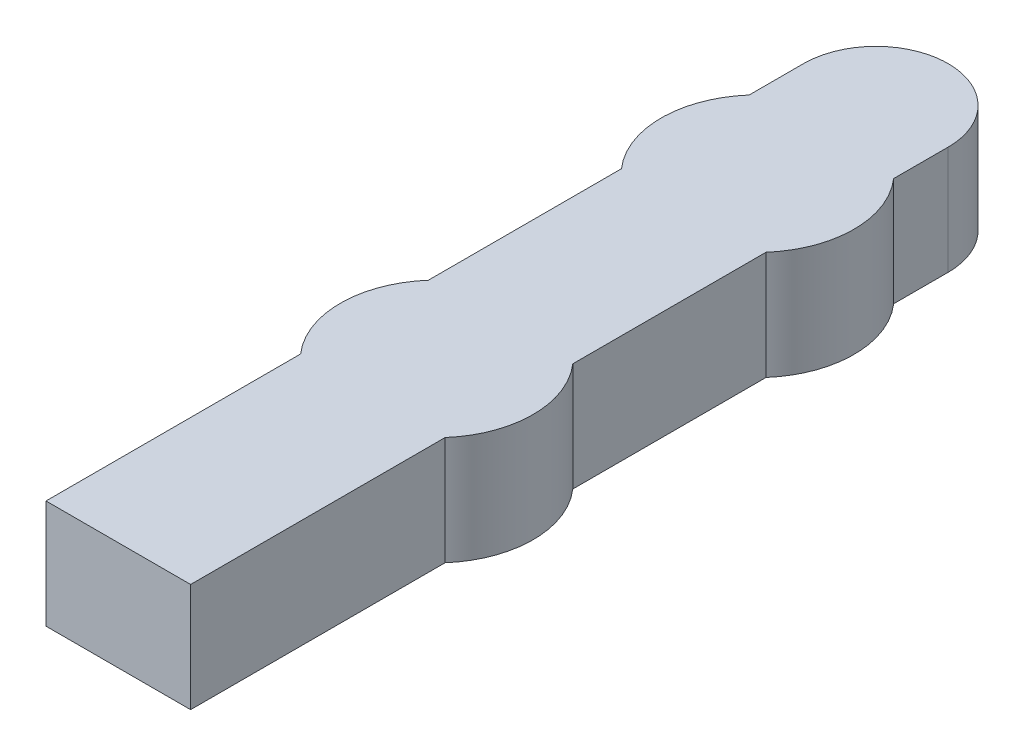
ISO-10303-21;
HEADER;
FILE_DESCRIPTION(('STEP AP214'),'2;1');
FILE_NAME('part.step','',(''),(''),'','','');
FILE_SCHEMA(('AUTOMOTIVE_DESIGN { 1 0 10303 214 1 1 1 1 }'));
ENDSEC;
DATA;
#1=APPLICATION_CONTEXT('core data for automotive mechanical design processes');
#2=APPLICATION_PROTOCOL_DEFINITION('international standard','automotive_design',2000,#1);
#3=PRODUCT_CONTEXT('',#1,'mechanical');
#4=PRODUCT('Part','Part','',(#3));
#5=PRODUCT_RELATED_PRODUCT_CATEGORY('part','',(#4));
#6=PRODUCT_DEFINITION_FORMATION('','',#4);
#7=PRODUCT_DEFINITION_CONTEXT('part definition',#1,'design');
#8=PRODUCT_DEFINITION('design','',#6,#7);
#9=PRODUCT_DEFINITION_SHAPE('','',#8);
#10=(LENGTH_UNIT() NAMED_UNIT(*) SI_UNIT(.MILLI.,.METRE.));
#11=(NAMED_UNIT(*) PLANE_ANGLE_UNIT() SI_UNIT($,.RADIAN.));
#12=(NAMED_UNIT(*) SI_UNIT($,.STERADIAN.) SOLID_ANGLE_UNIT());
#13=UNCERTAINTY_MEASURE_WITH_UNIT(LENGTH_MEASURE(1.E-05),#10,'distance_accuracy_value','');
#14=(GEOMETRIC_REPRESENTATION_CONTEXT(3) GLOBAL_UNCERTAINTY_ASSIGNED_CONTEXT((#13)) GLOBAL_UNIT_ASSIGNED_CONTEXT((#10,
#11,#12)) REPRESENTATION_CONTEXT('',''));
#15=CARTESIAN_POINT('',(0.,0.,0.));
#16=DIRECTION('',(0.,0.,1.));
#17=DIRECTION('',(1.,0.,0.));
#18=AXIS2_PLACEMENT_3D('',#15,#16,#17);
#19=CARTESIAN_POINT('',(-3.16909499193774,-36.5511805975622,-24.764773285915));
#20=DIRECTION('',(0.,-1.,0.));
#21=DIRECTION('',(0.,0.,-1.));
#22=AXIS2_PLACEMENT_3D('',#19,#20,#21);
#23=PLANE('',#22);
#24=CARTESIAN_POINT('',(-2.96909499193774,-36.5511805975622,-23.2791491687025));
#25=CARTESIAN_POINT('',(-3.2024283252711,-36.5511805975622,-23.543724299809));
#26=CARTESIAN_POINT('',(-2.96909499193772,-36.5511805975622,-23.8082994309155));
#27=(BOUNDED_CURVE() B_SPLINE_CURVE(2,(#24,#25,#26),.UNSPECIFIED.,.F.,
.F.) B_SPLINE_CURVE_WITH_KNOTS((3,3),(-11.5360013624518,-10.9578139642011),
.UNSPECIFIED.) CURVE() GEOMETRIC_REPRESENTATION_ITEM() RATIONAL_B_SPLINE_CURVE((1.,
0.749999999999968,1.)) REPRESENTATION_ITEM(''));
#28=CARTESIAN_POINT('',(-2.96909499193774,-36.5511805975622,-23.2791491687025));
#29=VERTEX_POINT('',#28);
#30=CARTESIAN_POINT('',(-2.96909499193772,-36.5511805975622,-23.8082994309155));
#31=VERTEX_POINT('',#30);
#32=EDGE_CURVE('E217',#29,#31,#27,.T.);
#33=ORIENTED_EDGE('',*,*,#32,.T.);
#34=CARTESIAN_POINT('',(-2.96909499193772,-36.5511805975622,-23.8082994309155));
#35=CARTESIAN_POINT('',(-2.96909499193773,-36.5511805975622,-23.9213501468244));
#36=CARTESIAN_POINT('',(-2.96909499193774,-36.5511805975622,-24.0344008627333));
#37=(BOUNDED_CURVE() B_SPLINE_CURVE(2,(#34,#35,#36),.UNSPECIFIED.,.F.,
.F.) B_SPLINE_CURVE_WITH_KNOTS((3,3),(-10.9578139642011,-10.7317125323832),
.UNSPECIFIED.) CURVE() GEOMETRIC_REPRESENTATION_ITEM() RATIONAL_B_SPLINE_CURVE((1.,1.,1.)) REPRESENTATION_ITEM(''));
#38=CARTESIAN_POINT('',(-2.96909499193774,-36.5511805975622,-24.0344008627333));
#39=VERTEX_POINT('',#38);
#40=EDGE_CURVE('E239',#31,#39,#37,.T.);
#41=ORIENTED_EDGE('',*,*,#40,.T.);
#42=CARTESIAN_POINT('',(-2.96909499193774,-36.5511805975622,-24.0344008627333));
#43=CARTESIAN_POINT('',(-2.96909499193775,-36.5511805975622,-24.3344008627333));
#44=CARTESIAN_POINT('',(-2.66909499193774,-36.5511805975622,-24.3344008627333));
#45=CARTESIAN_POINT('',(-2.36909499193774,-36.5511805975622,-24.3344008627333));
#46=CARTESIAN_POINT('',(-2.36909499193774,-36.5511805975622,-24.0344008627333));
#47=(BOUNDED_CURVE() B_SPLINE_CURVE(2,(#42,#43,#44,#45,#46),.UNSPECIFIED.,.F.,
.F.) B_SPLINE_CURVE_WITH_KNOTS((3,2,3),(-10.7317125323832,-10.2604736343447,-9.78923473630626),
.UNSPECIFIED.) CURVE() GEOMETRIC_REPRESENTATION_ITEM() RATIONAL_B_SPLINE_CURVE((1.,
0.707106781186548,1.,0.707106781186548,1.)) REPRESENTATION_ITEM(''));
#48=CARTESIAN_POINT('',(-2.36909499193774,-36.5511805975622,-24.0344008627333));
#49=VERTEX_POINT('',#48);
#50=EDGE_CURVE('E68',#39,#49,#47,.T.);
#51=ORIENTED_EDGE('',*,*,#50,.T.);
#52=CARTESIAN_POINT('',(-2.36909499193774,-36.5511805975622,-24.0344008627333));
#53=CARTESIAN_POINT('',(-2.36909499193774,-36.5511805975622,-23.9213501468244));
#54=CARTESIAN_POINT('',(-2.36909499193773,-36.5511805975622,-23.8082994309155));
#55=(BOUNDED_CURVE() B_SPLINE_CURVE(2,(#52,#53,#54),.UNSPECIFIED.,.F.,
.F.) B_SPLINE_CURVE_WITH_KNOTS((3,3),(-9.78923473630626,-9.56313330448839),
.UNSPECIFIED.) CURVE() GEOMETRIC_REPRESENTATION_ITEM() RATIONAL_B_SPLINE_CURVE((1.,1.,1.)) REPRESENTATION_ITEM(''));
#56=CARTESIAN_POINT('',(-2.36909499193773,-36.5511805975622,-23.8082994309155));
#57=VERTEX_POINT('',#56);
#58=EDGE_CURVE('E89',#49,#57,#55,.T.);
#59=ORIENTED_EDGE('',*,*,#58,.T.);
#60=CARTESIAN_POINT('',(-2.36909499193773,-36.5511805975622,-23.8082994309155));
#61=CARTESIAN_POINT('',(-2.13576165860442,-36.5511805975623,-23.5437242998091));
#62=CARTESIAN_POINT('',(-2.36909499193775,-36.5511805975622,-23.2791491687025));
#63=(BOUNDED_CURVE() B_SPLINE_CURVE(2,(#60,#61,#62),.UNSPECIFIED.,.F.,
.F.) B_SPLINE_CURVE_WITH_KNOTS((3,3),(-9.56313330448839,-8.98494590623766),
.UNSPECIFIED.) CURVE() GEOMETRIC_REPRESENTATION_ITEM() RATIONAL_B_SPLINE_CURVE((1.,0.75,1.)) REPRESENTATION_ITEM(''));
#64=CARTESIAN_POINT('',(-2.36909499193775,-36.5511805975622,-23.2791491687025));
#65=VERTEX_POINT('',#64);
#66=EDGE_CURVE('E182',#57,#65,#63,.T.);
#67=ORIENTED_EDGE('',*,*,#66,.T.);
#68=CARTESIAN_POINT('',(-2.36909499193775,-36.5511805975622,-23.2791491687025));
#69=CARTESIAN_POINT('',(-2.36909499193775,-36.5511805975622,-22.878090338546));
#70=CARTESIAN_POINT('',(-2.36909499193775,-36.5511805975622,-22.4770315083895));
#71=(BOUNDED_CURVE() B_SPLINE_CURVE(2,(#68,#69,#70),.UNSPECIFIED.,.F.,
.F.) B_SPLINE_CURVE_WITH_KNOTS((3,3),(-8.98494590623766,-8.18282824592458),
.UNSPECIFIED.) CURVE() GEOMETRIC_REPRESENTATION_ITEM() RATIONAL_B_SPLINE_CURVE((1.,1.,1.)) REPRESENTATION_ITEM(''));
#72=CARTESIAN_POINT('',(-2.36909499193775,-36.5511805975622,-22.4770315083895));
#73=VERTEX_POINT('',#72);
#74=EDGE_CURVE('E179',#65,#73,#71,.T.);
#75=ORIENTED_EDGE('',*,*,#74,.T.);
#76=CARTESIAN_POINT('',(-2.36909499193775,-36.5511805975622,-22.4770315083895));
#77=CARTESIAN_POINT('',(-2.13576165860439,-36.5511805975622,-22.212456377283));
#78=CARTESIAN_POINT('',(-2.36909499193775,-36.5511805975622,-21.9478812461765));
#79=(BOUNDED_CURVE() B_SPLINE_CURVE(2,(#76,#77,#78),.UNSPECIFIED.,.F.,
.F.) B_SPLINE_CURVE_WITH_KNOTS((3,3),(-8.18282824592458,-7.60464084767382),
.UNSPECIFIED.) CURVE() GEOMETRIC_REPRESENTATION_ITEM() RATIONAL_B_SPLINE_CURVE((1.,
0.74999999999998,1.)) REPRESENTATION_ITEM(''));
#80=CARTESIAN_POINT('',(-2.36909499193775,-36.5511805975622,-21.9478812461765));
#81=VERTEX_POINT('',#80);
#82=EDGE_CURVE('E166',#73,#81,#79,.T.);
#83=ORIENTED_EDGE('',*,*,#82,.T.);
#84=CARTESIAN_POINT('',(-2.36909499193775,-36.5511805975622,-21.9478812461765));
#85=CARTESIAN_POINT('',(-2.36909499193776,-36.5511805975622,-21.4196513617284));
#86=CARTESIAN_POINT('',(-2.36909499193776,-36.5511805975622,-20.8914214772802));
#87=(BOUNDED_CURVE() B_SPLINE_CURVE(2,(#84,#85,#86),.UNSPECIFIED.,.F.,
.F.) B_SPLINE_CURVE_WITH_KNOTS((3,3),(-7.60464084767382,-6.54818107877749),
.UNSPECIFIED.) CURVE() GEOMETRIC_REPRESENTATION_ITEM() RATIONAL_B_SPLINE_CURVE((1.,1.,1.)) REPRESENTATION_ITEM(''));
#88=CARTESIAN_POINT('',(-2.36909499193776,-36.5511805975622,-20.8914214772802));
#89=VERTEX_POINT('',#88);
#90=EDGE_CURVE('E22',#81,#89,#87,.T.);
#91=ORIENTED_EDGE('',*,*,#90,.T.);
#92=CARTESIAN_POINT('',(-2.36909499193776,-36.5511805975622,-20.8914214772802));
#93=CARTESIAN_POINT('',(-2.66909499193775,-36.5511805975622,-20.8914214772802));
#94=CARTESIAN_POINT('',(-2.96909499193774,-36.5511805975622,-20.8914214772802));
#95=(BOUNDED_CURVE() B_SPLINE_CURVE(2,(#92,#93,#94),.UNSPECIFIED.,.F.,
.F.) B_SPLINE_CURVE_WITH_KNOTS((3,3),(-6.54818107877749,-5.94818107877749),
.UNSPECIFIED.) CURVE() GEOMETRIC_REPRESENTATION_ITEM() RATIONAL_B_SPLINE_CURVE((1.,1.,1.)) REPRESENTATION_ITEM(''));
#96=CARTESIAN_POINT('',(-2.96909499193774,-36.5511805975622,-20.8914214772802));
#97=VERTEX_POINT('',#96);
#98=EDGE_CURVE('E144',#89,#97,#95,.T.);
#99=ORIENTED_EDGE('',*,*,#98,.T.);
#100=CARTESIAN_POINT('',(-2.96909499193774,-36.5511805975622,-20.8914214772802));
#101=CARTESIAN_POINT('',(-2.96909499193774,-36.5511805975622,-21.4196513617284));
#102=CARTESIAN_POINT('',(-2.96909499193774,-36.5511805975622,-21.9478812461765));
#103=(BOUNDED_CURVE() B_SPLINE_CURVE(2,(#100,#101,#102),.UNSPECIFIED.,.F.,
.F.) B_SPLINE_CURVE_WITH_KNOTS((3,3),(-5.94818107877749,-4.89172130988116),
.UNSPECIFIED.) CURVE() GEOMETRIC_REPRESENTATION_ITEM() RATIONAL_B_SPLINE_CURVE((1.,1.,1.)) REPRESENTATION_ITEM(''));
#104=CARTESIAN_POINT('',(-2.96909499193774,-36.5511805975622,-21.9478812461765));
#105=VERTEX_POINT('',#104);
#106=EDGE_CURVE('E290',#97,#105,#103,.T.);
#107=ORIENTED_EDGE('',*,*,#106,.T.);
#108=CARTESIAN_POINT('',(-2.96909499193774,-36.5511805975622,-21.9478812461765));
#109=CARTESIAN_POINT('',(-3.20242832527105,-36.5511805975619,-22.2124563772828));
#110=CARTESIAN_POINT('',(-2.96909499193774,-36.5511805975622,-22.4770315083895));
#111=(BOUNDED_CURVE() B_SPLINE_CURVE(2,(#108,#109,#110),.UNSPECIFIED.,.F.,
.F.) B_SPLINE_CURVE_WITH_KNOTS((3,3),(-4.89172130988116,-4.31353391163042),
.UNSPECIFIED.) CURVE() GEOMETRIC_REPRESENTATION_ITEM() RATIONAL_B_SPLINE_CURVE((1.,0.75,1.)) REPRESENTATION_ITEM(''));
#112=CARTESIAN_POINT('',(-2.96909499193774,-36.5511805975622,-22.4770315083895));
#113=VERTEX_POINT('',#112);
#114=EDGE_CURVE('E257',#105,#113,#111,.T.);
#115=ORIENTED_EDGE('',*,*,#114,.T.);
#116=CARTESIAN_POINT('',(-2.96909499193774,-36.5511805975622,-22.4770315083895));
#117=CARTESIAN_POINT('',(-2.96909499193774,-36.5511805975622,-22.878090338546));
#118=CARTESIAN_POINT('',(-2.96909499193774,-36.5511805975622,-23.2791491687025));
#119=(BOUNDED_CURVE() B_SPLINE_CURVE(2,(#116,#117,#118),.UNSPECIFIED.,.F.,
.F.) B_SPLINE_CURVE_WITH_KNOTS((3,3),(-4.31353391163042,-3.51141625131734),
.UNSPECIFIED.) CURVE() GEOMETRIC_REPRESENTATION_ITEM() RATIONAL_B_SPLINE_CURVE((1.,1.,1.)) REPRESENTATION_ITEM(''));
#120=EDGE_CURVE('E11',#113,#29,#119,.T.);
#121=ORIENTED_EDGE('',*,*,#120,.T.);
#122=EDGE_LOOP('',(#33,#41,#51,#59,#67,#75,#83,#91,#99,#107,#115,#121));
#123=FACE_BOUND('',#122,.T.);
#124=ADVANCED_FACE('F16',(#123),#23,.T.);
#125=CARTESIAN_POINT('',(-3.16909499193774,-36.1011805975622,-24.764773285915));
#126=DIRECTION('',(0.,1.,0.));
#127=DIRECTION('',(1.,0.,0.));
#128=AXIS2_PLACEMENT_3D('',#125,#126,#127);
#129=PLANE('',#128);
#130=CARTESIAN_POINT('',(-2.96909499193774,-36.1011805975622,-22.4770315083895));
#131=CARTESIAN_POINT('',(-2.96909499193774,-36.1011805975622,-22.878090338546));
#132=CARTESIAN_POINT('',(-2.96909499193774,-36.1011805975622,-23.2791491687025));
#133=(BOUNDED_CURVE() B_SPLINE_CURVE(2,(#130,#131,#132),.UNSPECIFIED.,.F.,
.F.) B_SPLINE_CURVE_WITH_KNOTS((3,3),(-4.31353391163042,-3.51141625131734),
.UNSPECIFIED.) CURVE() GEOMETRIC_REPRESENTATION_ITEM() RATIONAL_B_SPLINE_CURVE((1.,1.,1.)) REPRESENTATION_ITEM(''));
#134=CARTESIAN_POINT('',(-2.96909499193774,-36.1011805975622,-22.4770315083895));
#135=VERTEX_POINT('',#134);
#136=CARTESIAN_POINT('',(-2.96909499193774,-36.1011805975622,-23.2791491687025));
#137=VERTEX_POINT('',#136);
#138=EDGE_CURVE('E31',#135,#137,#133,.T.);
#139=ORIENTED_EDGE('',*,*,#138,.F.);
#140=CARTESIAN_POINT('',(-2.96909499193774,-36.1011805975622,-21.9478812461765));
#141=CARTESIAN_POINT('',(-3.20242832527105,-36.1011805975619,-22.2124563772828));
#142=CARTESIAN_POINT('',(-2.96909499193774,-36.1011805975622,-22.4770315083895));
#143=(BOUNDED_CURVE() B_SPLINE_CURVE(2,(#140,#141,#142),.UNSPECIFIED.,.F.,
.F.) B_SPLINE_CURVE_WITH_KNOTS((3,3),(-4.89172130988116,-4.31353391163042),
.UNSPECIFIED.) CURVE() GEOMETRIC_REPRESENTATION_ITEM() RATIONAL_B_SPLINE_CURVE((1.,0.75,1.)) REPRESENTATION_ITEM(''));
#144=CARTESIAN_POINT('',(-2.96909499193774,-36.1011805975622,-21.9478812461765));
#145=VERTEX_POINT('',#144);
#146=EDGE_CURVE('E363',#145,#135,#143,.T.);
#147=ORIENTED_EDGE('',*,*,#146,.F.);
#148=CARTESIAN_POINT('',(-2.96909499193774,-36.1011805975622,-20.8914214772802));
#149=CARTESIAN_POINT('',(-2.96909499193774,-36.1011805975622,-21.4196513617284));
#150=CARTESIAN_POINT('',(-2.96909499193774,-36.1011805975622,-21.9478812461765));
#151=(BOUNDED_CURVE() B_SPLINE_CURVE(2,(#148,#149,#150),.UNSPECIFIED.,.F.,
.F.) B_SPLINE_CURVE_WITH_KNOTS((3,3),(-5.94818107877749,-4.89172130988116),
.UNSPECIFIED.) CURVE() GEOMETRIC_REPRESENTATION_ITEM() RATIONAL_B_SPLINE_CURVE((1.,1.,1.)) REPRESENTATION_ITEM(''));
#152=CARTESIAN_POINT('',(-2.96909499193774,-36.1011805975622,-20.8914214772802));
#153=VERTEX_POINT('',#152);
#154=EDGE_CURVE('E128',#153,#145,#151,.T.);
#155=ORIENTED_EDGE('',*,*,#154,.F.);
#156=CARTESIAN_POINT('',(-2.36909499193776,-36.1011805975622,-20.8914214772802));
#157=CARTESIAN_POINT('',(-2.66909499193775,-36.1011805975622,-20.8914214772802));
#158=CARTESIAN_POINT('',(-2.96909499193774,-36.1011805975622,-20.8914214772802));
#159=(BOUNDED_CURVE() B_SPLINE_CURVE(2,(#156,#157,#158),.UNSPECIFIED.,.F.,
.F.) B_SPLINE_CURVE_WITH_KNOTS((3,3),(-6.54818107877749,-5.94818107877749),
.UNSPECIFIED.) CURVE() GEOMETRIC_REPRESENTATION_ITEM() RATIONAL_B_SPLINE_CURVE((1.,1.,1.)) REPRESENTATION_ITEM(''));
#160=CARTESIAN_POINT('',(-2.36909499193776,-36.1011805975622,-20.8914214772802));
#161=VERTEX_POINT('',#160);
#162=EDGE_CURVE('E256',#161,#153,#159,.T.);
#163=ORIENTED_EDGE('',*,*,#162,.F.);
#164=CARTESIAN_POINT('',(-2.36909499193775,-36.1011805975622,-21.9478812461765));
#165=CARTESIAN_POINT('',(-2.36909499193776,-36.1011805975622,-21.4196513617284));
#166=CARTESIAN_POINT('',(-2.36909499193776,-36.1011805975622,-20.8914214772802));
#167=(BOUNDED_CURVE() B_SPLINE_CURVE(2,(#164,#165,#166),.UNSPECIFIED.,.F.,
.F.) B_SPLINE_CURVE_WITH_KNOTS((3,3),(-7.60464084767382,-6.54818107877749),
.UNSPECIFIED.) CURVE() GEOMETRIC_REPRESENTATION_ITEM() RATIONAL_B_SPLINE_CURVE((1.,1.,1.)) REPRESENTATION_ITEM(''));
#168=CARTESIAN_POINT('',(-2.36909499193775,-36.1011805975622,-21.9478812461765));
#169=VERTEX_POINT('',#168);
#170=EDGE_CURVE('E176',#169,#161,#167,.T.);
#171=ORIENTED_EDGE('',*,*,#170,.F.);
#172=CARTESIAN_POINT('',(-2.36909499193775,-36.1011805975622,-22.4770315083895));
#173=CARTESIAN_POINT('',(-2.13576165860439,-36.1011805975622,-22.212456377283));
#174=CARTESIAN_POINT('',(-2.36909499193775,-36.1011805975622,-21.9478812461765));
#175=(BOUNDED_CURVE() B_SPLINE_CURVE(2,(#172,#173,#174),.UNSPECIFIED.,.F.,
.F.) B_SPLINE_CURVE_WITH_KNOTS((3,3),(-8.18282824592458,-7.60464084767382),
.UNSPECIFIED.) CURVE() GEOMETRIC_REPRESENTATION_ITEM() RATIONAL_B_SPLINE_CURVE((1.,
0.74999999999998,1.)) REPRESENTATION_ITEM(''));
#176=CARTESIAN_POINT('',(-2.36909499193775,-36.1011805975622,-22.4770315083895));
#177=VERTEX_POINT('',#176);
#178=EDGE_CURVE('E158',#177,#169,#175,.T.);
#179=ORIENTED_EDGE('',*,*,#178,.F.);
#180=CARTESIAN_POINT('',(-2.36909499193775,-36.1011805975622,-23.2791491687025));
#181=CARTESIAN_POINT('',(-2.36909499193775,-36.1011805975622,-22.878090338546));
#182=CARTESIAN_POINT('',(-2.36909499193775,-36.1011805975622,-22.4770315083895));
#183=(BOUNDED_CURVE() B_SPLINE_CURVE(2,(#180,#181,#182),.UNSPECIFIED.,.F.,
.F.) B_SPLINE_CURVE_WITH_KNOTS((3,3),(-8.98494590623766,-8.18282824592458),
.UNSPECIFIED.) CURVE() GEOMETRIC_REPRESENTATION_ITEM() RATIONAL_B_SPLINE_CURVE((1.,1.,1.)) REPRESENTATION_ITEM(''));
#184=CARTESIAN_POINT('',(-2.36909499193775,-36.1011805975622,-23.2791491687025));
#185=VERTEX_POINT('',#184);
#186=EDGE_CURVE('E189',#185,#177,#183,.T.);
#187=ORIENTED_EDGE('',*,*,#186,.F.);
#188=CARTESIAN_POINT('',(-2.36909499193773,-36.1011805975622,-23.8082994309155));
#189=CARTESIAN_POINT('',(-2.13576165860442,-36.1011805975623,-23.5437242998091));
#190=CARTESIAN_POINT('',(-2.36909499193775,-36.1011805975622,-23.2791491687025));
#191=(BOUNDED_CURVE() B_SPLINE_CURVE(2,(#188,#189,#190),.UNSPECIFIED.,.F.,
.F.) B_SPLINE_CURVE_WITH_KNOTS((3,3),(-9.56313330448839,-8.98494590623766),
.UNSPECIFIED.) CURVE() GEOMETRIC_REPRESENTATION_ITEM() RATIONAL_B_SPLINE_CURVE((1.,0.75,1.)) REPRESENTATION_ITEM(''));
#192=CARTESIAN_POINT('',(-2.36909499193773,-36.1011805975622,-23.8082994309155));
#193=VERTEX_POINT('',#192);
#194=EDGE_CURVE('E300',#193,#185,#191,.T.);
#195=ORIENTED_EDGE('',*,*,#194,.F.);
#196=CARTESIAN_POINT('',(-2.36909499193774,-36.1011805975622,-24.0344008627333));
#197=CARTESIAN_POINT('',(-2.36909499193774,-36.1011805975622,-23.9213501468244));
#198=CARTESIAN_POINT('',(-2.36909499193773,-36.1011805975622,-23.8082994309155));
#199=(BOUNDED_CURVE() B_SPLINE_CURVE(2,(#196,#197,#198),.UNSPECIFIED.,.F.,
.F.) B_SPLINE_CURVE_WITH_KNOTS((3,3),(-9.78923473630626,-9.56313330448839),
.UNSPECIFIED.) CURVE() GEOMETRIC_REPRESENTATION_ITEM() RATIONAL_B_SPLINE_CURVE((1.,1.,1.)) REPRESENTATION_ITEM(''));
#200=CARTESIAN_POINT('',(-2.36909499193774,-36.1011805975622,-24.0344008627333));
#201=VERTEX_POINT('',#200);
#202=EDGE_CURVE('E77',#201,#193,#199,.T.);
#203=ORIENTED_EDGE('',*,*,#202,.F.);
#204=CARTESIAN_POINT('',(-2.96909499193774,-36.1011805975622,-24.0344008627333));
#205=CARTESIAN_POINT('',(-2.96909499193775,-36.1011805975622,-24.3344008627333));
#206=CARTESIAN_POINT('',(-2.66909499193774,-36.1011805975622,-24.3344008627333));
#207=CARTESIAN_POINT('',(-2.36909499193774,-36.1011805975622,-24.3344008627333));
#208=CARTESIAN_POINT('',(-2.36909499193774,-36.1011805975622,-24.0344008627333));
#209=(BOUNDED_CURVE() B_SPLINE_CURVE(2,(#204,#205,#206,#207,#208),.UNSPECIFIED.,.F.,
.F.) B_SPLINE_CURVE_WITH_KNOTS((3,2,3),(-10.7317125323832,-10.2604736343447,-9.78923473630626),
.UNSPECIFIED.) CURVE() GEOMETRIC_REPRESENTATION_ITEM() RATIONAL_B_SPLINE_CURVE((1.,
0.707106781186548,1.,0.707106781186548,1.)) REPRESENTATION_ITEM(''));
#210=CARTESIAN_POINT('',(-2.96909499193774,-36.1011805975622,-24.0344008627333));
#211=VERTEX_POINT('',#210);
#212=EDGE_CURVE('E247',#211,#201,#209,.T.);
#213=ORIENTED_EDGE('',*,*,#212,.F.);
#214=CARTESIAN_POINT('',(-2.96909499193772,-36.1011805975622,-23.8082994309155));
#215=CARTESIAN_POINT('',(-2.96909499193773,-36.1011805975622,-23.9213501468244));
#216=CARTESIAN_POINT('',(-2.96909499193774,-36.1011805975622,-24.0344008627333));
#217=(BOUNDED_CURVE() B_SPLINE_CURVE(2,(#214,#215,#216),.UNSPECIFIED.,.F.,
.F.) B_SPLINE_CURVE_WITH_KNOTS((3,3),(-10.9578139642011,-10.7317125323832),
.UNSPECIFIED.) CURVE() GEOMETRIC_REPRESENTATION_ITEM() RATIONAL_B_SPLINE_CURVE((1.,1.,1.)) REPRESENTATION_ITEM(''));
#218=CARTESIAN_POINT('',(-2.96909499193772,-36.1011805975622,-23.8082994309155));
#219=VERTEX_POINT('',#218);
#220=EDGE_CURVE('E199',#219,#211,#217,.T.);
#221=ORIENTED_EDGE('',*,*,#220,.F.);
#222=CARTESIAN_POINT('',(-2.96909499193774,-36.1011805975622,-23.2791491687025));
#223=CARTESIAN_POINT('',(-3.2024283252711,-36.1011805975622,-23.543724299809));
#224=CARTESIAN_POINT('',(-2.96909499193772,-36.1011805975622,-23.8082994309155));
#225=(BOUNDED_CURVE() B_SPLINE_CURVE(2,(#222,#223,#224),.UNSPECIFIED.,.F.,
.F.) B_SPLINE_CURVE_WITH_KNOTS((3,3),(-11.5360013624518,-10.9578139642011),
.UNSPECIFIED.) CURVE() GEOMETRIC_REPRESENTATION_ITEM() RATIONAL_B_SPLINE_CURVE((1.,
0.749999999999968,1.)) REPRESENTATION_ITEM(''));
#226=EDGE_CURVE('E291',#137,#219,#225,.T.);
#227=ORIENTED_EDGE('',*,*,#226,.F.);
#228=EDGE_LOOP('',(#139,#147,#155,#163,#171,#179,#187,#195,#203,#213,#221,#227));
#229=FACE_BOUND('',#228,.T.);
#230=ADVANCED_FACE('F467',(#229),#129,.T.);
#231=CARTESIAN_POINT('',(-2.96909499193774,-36.1011805975622,-22.4770315083895));
#232=CARTESIAN_POINT('',(-2.96909499193774,-36.5511805975622,-22.4770315083895));
#233=CARTESIAN_POINT('',(-2.96909499193774,-36.1011805975622,-22.878090338546));
#234=CARTESIAN_POINT('',(-2.96909499193774,-36.5511805975622,-22.878090338546));
#235=CARTESIAN_POINT('',(-2.96909499193774,-36.1011805975622,-23.2791491687025));
#236=CARTESIAN_POINT('',(-2.96909499193774,-36.5511805975622,-23.2791491687025));
#237=(BOUNDED_SURFACE() B_SPLINE_SURFACE(2,1,((#231,#232),(#233,#234),(#235,#236)),
.UNSPECIFIED.,.F.,.F.,.F.) B_SPLINE_SURFACE_WITH_KNOTS((3,3),(2,2),(-4.31353391163042,
-3.51141625131734),(0.,0.45),
.UNSPECIFIED.) GEOMETRIC_REPRESENTATION_ITEM() RATIONAL_B_SPLINE_SURFACE(((1.,1.),(1.,1.),(1.,1.))) REPRESENTATION_ITEM('') SURFACE());
#238=CARTESIAN_POINT('',(-2.96909499193774,-36.1011805975622,-23.2791491687025));
#239=CARTESIAN_POINT('',(-2.96909499193774,-36.5511805975622,-23.2791491687025));
#240=(BOUNDED_CURVE() B_SPLINE_CURVE(1,(#238,#239),.UNSPECIFIED.,.F.,
.F.) B_SPLINE_CURVE_WITH_KNOTS((2,2),(0.,0.45),
.UNSPECIFIED.) CURVE() GEOMETRIC_REPRESENTATION_ITEM() RATIONAL_B_SPLINE_CURVE((1.,1.)) REPRESENTATION_ITEM(''));
#241=EDGE_CURVE('E208',#137,#29,#240,.T.);
#242=CARTESIAN_POINT('',(-2.96909499193774,-36.1011805975622,-22.4770315083895));
#243=CARTESIAN_POINT('',(-2.96909499193774,-36.5511805975622,-22.4770315083895));
#244=(BOUNDED_CURVE() B_SPLINE_CURVE(1,(#242,#243),.UNSPECIFIED.,.F.,
.F.) B_SPLINE_CURVE_WITH_KNOTS((2,2),(0.,0.45),
.UNSPECIFIED.) CURVE() GEOMETRIC_REPRESENTATION_ITEM() RATIONAL_B_SPLINE_CURVE((1.,1.)) REPRESENTATION_ITEM(''));
#245=EDGE_CURVE('E265',#135,#113,#244,.T.);
#246=ORIENTED_EDGE('',*,*,#138,.T.);
#247=ORIENTED_EDGE('',*,*,#241,.T.);
#248=ORIENTED_EDGE('',*,*,#120,.F.);
#249=ORIENTED_EDGE('',*,*,#245,.F.);
#250=EDGE_LOOP('',(#246,#247,#248,#249));
#251=FACE_BOUND('',#250,.T.);
#252=ADVANCED_FACE('F475',(#251),#237,.T.);
#253=CARTESIAN_POINT('',(-2.96909499193774,-36.1011805975622,-21.9478812461765));
#254=CARTESIAN_POINT('',(-2.96909499193774,-36.5511805975622,-21.9478812461765));
#255=CARTESIAN_POINT('',(-3.20242832527105,-36.1011805975619,-22.2124563772828));
#256=CARTESIAN_POINT('',(-3.20242832527105,-36.5511805975619,-22.2124563772828));
#257=CARTESIAN_POINT('',(-2.96909499193774,-36.1011805975622,-22.4770315083895));
#258=CARTESIAN_POINT('',(-2.96909499193774,-36.5511805975622,-22.4770315083895));
#259=(BOUNDED_SURFACE() B_SPLINE_SURFACE(2,1,((#253,#254),(#255,#256),(#257,#258)),
.UNSPECIFIED.,.F.,.F.,.F.) B_SPLINE_SURFACE_WITH_KNOTS((3,3),(2,2),(-4.89172130988116,
-4.31353391163042),(0.,0.45),
.UNSPECIFIED.) GEOMETRIC_REPRESENTATION_ITEM() RATIONAL_B_SPLINE_SURFACE(((1.,1.),(0.75,0.75),
(1.,1.))) REPRESENTATION_ITEM('') SURFACE());
#260=CARTESIAN_POINT('',(-2.96909499193774,-36.1011805975622,-21.9478812461765));
#261=CARTESIAN_POINT('',(-2.96909499193774,-36.5511805975622,-21.9478812461765));
#262=(BOUNDED_CURVE() B_SPLINE_CURVE(1,(#260,#261),.UNSPECIFIED.,.F.,
.F.) B_SPLINE_CURVE_WITH_KNOTS((2,2),(0.,0.45),
.UNSPECIFIED.) CURVE() GEOMETRIC_REPRESENTATION_ITEM() RATIONAL_B_SPLINE_CURVE((1.,1.)) REPRESENTATION_ITEM(''));
#263=EDGE_CURVE('E238',#145,#105,#262,.T.);
#264=ORIENTED_EDGE('',*,*,#146,.T.);
#265=ORIENTED_EDGE('',*,*,#245,.T.);
#266=ORIENTED_EDGE('',*,*,#114,.F.);
#267=ORIENTED_EDGE('',*,*,#263,.F.);
#268=EDGE_LOOP('',(#264,#265,#266,#267));
#269=FACE_BOUND('',#268,.T.);
#270=ADVANCED_FACE('F466',(#269),#259,.T.);
#271=CARTESIAN_POINT('',(-2.96909499193774,-36.1011805975622,-20.8914214772802));
#272=CARTESIAN_POINT('',(-2.96909499193774,-36.5511805975622,-20.8914214772802));
#273=CARTESIAN_POINT('',(-2.96909499193774,-36.1011805975622,-21.4196513617284));
#274=CARTESIAN_POINT('',(-2.96909499193774,-36.5511805975622,-21.4196513617284));
#275=CARTESIAN_POINT('',(-2.96909499193774,-36.1011805975622,-21.9478812461765));
#276=CARTESIAN_POINT('',(-2.96909499193774,-36.5511805975622,-21.9478812461765));
#277=(BOUNDED_SURFACE() B_SPLINE_SURFACE(2,1,((#271,#272),(#273,#274),(#275,#276)),
.UNSPECIFIED.,.F.,.F.,.F.) B_SPLINE_SURFACE_WITH_KNOTS((3,3),(2,2),(-5.94818107877749,
-4.89172130988116),(0.,0.45),
.UNSPECIFIED.) GEOMETRIC_REPRESENTATION_ITEM() RATIONAL_B_SPLINE_SURFACE(((1.,1.),(1.,1.),(1.,1.))) REPRESENTATION_ITEM('') SURFACE());
#278=CARTESIAN_POINT('',(-2.96909499193774,-36.1011805975622,-20.8914214772802));
#279=CARTESIAN_POINT('',(-2.96909499193774,-36.5511805975622,-20.8914214772802));
#280=(BOUNDED_CURVE() B_SPLINE_CURVE(1,(#278,#279),.UNSPECIFIED.,.F.,
.F.) B_SPLINE_CURVE_WITH_KNOTS((2,2),(0.,0.45),
.UNSPECIFIED.) CURVE() GEOMETRIC_REPRESENTATION_ITEM() RATIONAL_B_SPLINE_CURVE((1.,1.)) REPRESENTATION_ITEM(''));
#281=EDGE_CURVE('E248',#153,#97,#280,.T.);
#282=ORIENTED_EDGE('',*,*,#154,.T.);
#283=ORIENTED_EDGE('',*,*,#263,.T.);
#284=ORIENTED_EDGE('',*,*,#106,.F.);
#285=ORIENTED_EDGE('',*,*,#281,.F.);
#286=EDGE_LOOP('',(#282,#283,#284,#285));
#287=FACE_BOUND('',#286,.T.);
#288=ADVANCED_FACE('F483',(#287),#277,.T.);
#289=CARTESIAN_POINT('',(-2.36909499193776,-36.1011805975622,-20.8914214772802));
#290=CARTESIAN_POINT('',(-2.36909499193776,-36.5511805975622,-20.8914214772802));
#291=CARTESIAN_POINT('',(-2.66909499193775,-36.1011805975622,-20.8914214772802));
#292=CARTESIAN_POINT('',(-2.66909499193775,-36.5511805975622,-20.8914214772802));
#293=CARTESIAN_POINT('',(-2.96909499193774,-36.1011805975622,-20.8914214772802));
#294=CARTESIAN_POINT('',(-2.96909499193774,-36.5511805975622,-20.8914214772802));
#295=(BOUNDED_SURFACE() B_SPLINE_SURFACE(2,1,((#289,#290),(#291,#292),(#293,#294)),
.UNSPECIFIED.,.F.,.F.,.F.) B_SPLINE_SURFACE_WITH_KNOTS((3,3),(2,2),(-6.54818107877749,
-5.94818107877749),(0.,0.45),
.UNSPECIFIED.) GEOMETRIC_REPRESENTATION_ITEM() RATIONAL_B_SPLINE_SURFACE(((1.,1.),(1.,1.),(1.,1.))) REPRESENTATION_ITEM('') SURFACE());
#296=CARTESIAN_POINT('',(-2.36909499193776,-36.1011805975622,-20.8914214772802));
#297=CARTESIAN_POINT('',(-2.36909499193776,-36.5511805975622,-20.8914214772802));
#298=(BOUNDED_CURVE() B_SPLINE_CURVE(1,(#296,#297),.UNSPECIFIED.,.F.,
.F.) B_SPLINE_CURVE_WITH_KNOTS((2,2),(0.,0.45),
.UNSPECIFIED.) CURVE() GEOMETRIC_REPRESENTATION_ITEM() RATIONAL_B_SPLINE_CURVE((1.,1.)) REPRESENTATION_ITEM(''));
#299=EDGE_CURVE('E281',#161,#89,#298,.T.);
#300=ORIENTED_EDGE('',*,*,#162,.T.);
#301=ORIENTED_EDGE('',*,*,#281,.T.);
#302=ORIENTED_EDGE('',*,*,#98,.F.);
#303=ORIENTED_EDGE('',*,*,#299,.F.);
#304=EDGE_LOOP('',(#300,#301,#302,#303));
#305=FACE_BOUND('',#304,.T.);
#306=ADVANCED_FACE('F529',(#305),#295,.T.);
#307=CARTESIAN_POINT('',(-2.36909499193775,-36.1011805975622,-21.9478812461765));
#308=CARTESIAN_POINT('',(-2.36909499193775,-36.5511805975622,-21.9478812461765));
#309=CARTESIAN_POINT('',(-2.36909499193776,-36.1011805975622,-21.4196513617284));
#310=CARTESIAN_POINT('',(-2.36909499193776,-36.5511805975622,-21.4196513617284));
#311=CARTESIAN_POINT('',(-2.36909499193776,-36.1011805975622,-20.8914214772802));
#312=CARTESIAN_POINT('',(-2.36909499193776,-36.5511805975622,-20.8914214772802));
#313=(BOUNDED_SURFACE() B_SPLINE_SURFACE(2,1,((#307,#308),(#309,#310),(#311,#312)),
.UNSPECIFIED.,.F.,.F.,.F.) B_SPLINE_SURFACE_WITH_KNOTS((3,3),(2,2),(-7.60464084767382,
-6.54818107877749),(0.,0.45),
.UNSPECIFIED.) GEOMETRIC_REPRESENTATION_ITEM() RATIONAL_B_SPLINE_SURFACE(((1.,1.),(1.,1.),(1.,1.))) REPRESENTATION_ITEM('') SURFACE());
#314=CARTESIAN_POINT('',(-2.36909499193775,-36.1011805975622,-21.9478812461765));
#315=CARTESIAN_POINT('',(-2.36909499193775,-36.5511805975622,-21.9478812461765));
#316=(BOUNDED_CURVE() B_SPLINE_CURVE(1,(#314,#315),.UNSPECIFIED.,.F.,
.F.) B_SPLINE_CURVE_WITH_KNOTS((2,2),(0.,0.45),
.UNSPECIFIED.) CURVE() GEOMETRIC_REPRESENTATION_ITEM() RATIONAL_B_SPLINE_CURVE((1.,1.)) REPRESENTATION_ITEM(''));
#317=EDGE_CURVE('E173',#169,#81,#316,.T.);
#318=ORIENTED_EDGE('',*,*,#170,.T.);
#319=ORIENTED_EDGE('',*,*,#299,.T.);
#320=ORIENTED_EDGE('',*,*,#90,.F.);
#321=ORIENTED_EDGE('',*,*,#317,.F.);
#322=EDGE_LOOP('',(#318,#319,#320,#321));
#323=FACE_BOUND('',#322,.T.);
#324=ADVANCED_FACE('F498',(#323),#313,.T.);
#325=CARTESIAN_POINT('',(-2.36909499193775,-36.1011805975622,-22.4770315083895));
#326=CARTESIAN_POINT('',(-2.36909499193775,-36.5511805975622,-22.4770315083895));
#327=CARTESIAN_POINT('',(-2.13576165860439,-36.1011805975622,-22.212456377283));
#328=CARTESIAN_POINT('',(-2.13576165860439,-36.5511805975622,-22.212456377283));
#329=CARTESIAN_POINT('',(-2.36909499193775,-36.1011805975622,-21.9478812461765));
#330=CARTESIAN_POINT('',(-2.36909499193775,-36.5511805975622,-21.9478812461765));
#331=(BOUNDED_SURFACE() B_SPLINE_SURFACE(2,1,((#325,#326),(#327,#328),(#329,#330)),
.UNSPECIFIED.,.F.,.F.,.F.) B_SPLINE_SURFACE_WITH_KNOTS((3,3),(2,2),(-8.18282824592458,
-7.60464084767382),(0.,0.45),
.UNSPECIFIED.) GEOMETRIC_REPRESENTATION_ITEM() RATIONAL_B_SPLINE_SURFACE(((1.,1.),
(0.74999999999998,0.74999999999998),(1.,1.))) REPRESENTATION_ITEM('') SURFACE());
#332=CARTESIAN_POINT('',(-2.36909499193775,-36.1011805975622,-22.4770315083895));
#333=CARTESIAN_POINT('',(-2.36909499193775,-36.5511805975622,-22.4770315083895));
#334=(BOUNDED_CURVE() B_SPLINE_CURVE(1,(#332,#333),.UNSPECIFIED.,.F.,
.F.) B_SPLINE_CURVE_WITH_KNOTS((2,2),(0.,0.45),
.UNSPECIFIED.) CURVE() GEOMETRIC_REPRESENTATION_ITEM() RATIONAL_B_SPLINE_CURVE((1.,1.)) REPRESENTATION_ITEM(''));
#335=EDGE_CURVE('E170',#177,#73,#334,.T.);
#336=ORIENTED_EDGE('',*,*,#178,.T.);
#337=ORIENTED_EDGE('',*,*,#317,.T.);
#338=ORIENTED_EDGE('',*,*,#82,.F.);
#339=ORIENTED_EDGE('',*,*,#335,.F.);
#340=EDGE_LOOP('',(#336,#337,#338,#339));
#341=FACE_BOUND('',#340,.T.);
#342=ADVANCED_FACE('F168',(#341),#331,.T.);
#343=CARTESIAN_POINT('',(-2.36909499193775,-36.1011805975622,-23.2791491687025));
#344=CARTESIAN_POINT('',(-2.36909499193775,-36.5511805975622,-23.2791491687025));
#345=CARTESIAN_POINT('',(-2.36909499193775,-36.1011805975622,-22.878090338546));
#346=CARTESIAN_POINT('',(-2.36909499193775,-36.5511805975622,-22.878090338546));
#347=CARTESIAN_POINT('',(-2.36909499193775,-36.1011805975622,-22.4770315083895));
#348=CARTESIAN_POINT('',(-2.36909499193775,-36.5511805975622,-22.4770315083895));
#349=(BOUNDED_SURFACE() B_SPLINE_SURFACE(2,1,((#343,#344),(#345,#346),(#347,#348)),
.UNSPECIFIED.,.F.,.F.,.F.) B_SPLINE_SURFACE_WITH_KNOTS((3,3),(2,2),(-8.98494590623766,
-8.18282824592458),(0.,0.45),
.UNSPECIFIED.) GEOMETRIC_REPRESENTATION_ITEM() RATIONAL_B_SPLINE_SURFACE(((1.,1.),(1.,1.),(1.,1.))) REPRESENTATION_ITEM('') SURFACE());
#350=CARTESIAN_POINT('',(-2.36909499193775,-36.1011805975622,-23.2791491687025));
#351=CARTESIAN_POINT('',(-2.36909499193775,-36.5511805975622,-23.2791491687025));
#352=(BOUNDED_CURVE() B_SPLINE_CURVE(1,(#350,#351),.UNSPECIFIED.,.F.,
.F.) B_SPLINE_CURVE_WITH_KNOTS((2,2),(0.,0.45),
.UNSPECIFIED.) CURVE() GEOMETRIC_REPRESENTATION_ITEM() RATIONAL_B_SPLINE_CURVE((1.,1.)) REPRESENTATION_ITEM(''));
#353=EDGE_CURVE('E308',#185,#65,#352,.T.);
#354=ORIENTED_EDGE('',*,*,#186,.T.);
#355=ORIENTED_EDGE('',*,*,#335,.T.);
#356=ORIENTED_EDGE('',*,*,#74,.F.);
#357=ORIENTED_EDGE('',*,*,#353,.F.);
#358=EDGE_LOOP('',(#354,#355,#356,#357));
#359=FACE_BOUND('',#358,.T.);
#360=ADVANCED_FACE('F188',(#359),#349,.T.);
#361=CARTESIAN_POINT('',(-2.36909499193773,-36.1011805975622,-23.8082994309155));
#362=CARTESIAN_POINT('',(-2.36909499193773,-36.5511805975622,-23.8082994309155));
#363=CARTESIAN_POINT('',(-2.13576165860442,-36.1011805975623,-23.5437242998091));
#364=CARTESIAN_POINT('',(-2.13576165860442,-36.5511805975623,-23.5437242998091));
#365=CARTESIAN_POINT('',(-2.36909499193775,-36.1011805975622,-23.2791491687025));
#366=CARTESIAN_POINT('',(-2.36909499193775,-36.5511805975622,-23.2791491687025));
#367=(BOUNDED_SURFACE() B_SPLINE_SURFACE(2,1,((#361,#362),(#363,#364),(#365,#366)),
.UNSPECIFIED.,.F.,.F.,.F.) B_SPLINE_SURFACE_WITH_KNOTS((3,3),(2,2),(-9.56313330448839,
-8.98494590623766),(0.,0.45),
.UNSPECIFIED.) GEOMETRIC_REPRESENTATION_ITEM() RATIONAL_B_SPLINE_SURFACE(((1.,1.),(0.75,0.75),
(1.,1.))) REPRESENTATION_ITEM('') SURFACE());
#368=CARTESIAN_POINT('',(-2.36909499193773,-36.1011805975622,-23.8082994309155));
#369=CARTESIAN_POINT('',(-2.36909499193773,-36.5511805975622,-23.8082994309155));
#370=(BOUNDED_CURVE() B_SPLINE_CURVE(1,(#368,#369),.UNSPECIFIED.,.F.,
.F.) B_SPLINE_CURVE_WITH_KNOTS((2,2),(0.,0.45),
.UNSPECIFIED.) CURVE() GEOMETRIC_REPRESENTATION_ITEM() RATIONAL_B_SPLINE_CURVE((1.,1.)) REPRESENTATION_ITEM(''));
#371=EDGE_CURVE('E216',#193,#57,#370,.T.);
#372=ORIENTED_EDGE('',*,*,#194,.T.);
#373=ORIENTED_EDGE('',*,*,#353,.T.);
#374=ORIENTED_EDGE('',*,*,#66,.F.);
#375=ORIENTED_EDGE('',*,*,#371,.F.);
#376=EDGE_LOOP('',(#372,#373,#374,#375));
#377=FACE_BOUND('',#376,.T.);
#378=ADVANCED_FACE('F18',(#377),#367,.T.);
#379=CARTESIAN_POINT('',(-2.36909499193774,-36.1011805975622,-24.0344008627333));
#380=CARTESIAN_POINT('',(-2.36909499193774,-36.5511805975622,-24.0344008627333));
#381=CARTESIAN_POINT('',(-2.36909499193774,-36.1011805975622,-23.9213501468244));
#382=CARTESIAN_POINT('',(-2.36909499193774,-36.5511805975622,-23.9213501468244));
#383=CARTESIAN_POINT('',(-2.36909499193773,-36.1011805975622,-23.8082994309155));
#384=CARTESIAN_POINT('',(-2.36909499193773,-36.5511805975622,-23.8082994309155));
#385=(BOUNDED_SURFACE() B_SPLINE_SURFACE(2,1,((#379,#380),(#381,#382),(#383,#384)),
.UNSPECIFIED.,.F.,.F.,.F.) B_SPLINE_SURFACE_WITH_KNOTS((3,3),(2,2),(-9.78923473630626,
-9.56313330448839),(0.,0.45),
.UNSPECIFIED.) GEOMETRIC_REPRESENTATION_ITEM() RATIONAL_B_SPLINE_SURFACE(((1.,1.),(1.,1.),(1.,1.))) REPRESENTATION_ITEM('') SURFACE());
#386=CARTESIAN_POINT('',(-2.36909499193774,-36.1011805975622,-24.0344008627333));
#387=CARTESIAN_POINT('',(-2.36909499193774,-36.5511805975622,-24.0344008627333));
#388=(BOUNDED_CURVE() B_SPLINE_CURVE(1,(#386,#387),.UNSPECIFIED.,.F.,
.F.) B_SPLINE_CURVE_WITH_KNOTS((2,2),(0.,0.45),
.UNSPECIFIED.) CURVE() GEOMETRIC_REPRESENTATION_ITEM() RATIONAL_B_SPLINE_CURVE((1.,1.)) REPRESENTATION_ITEM(''));
#389=EDGE_CURVE('E338',#201,#49,#388,.T.);
#390=ORIENTED_EDGE('',*,*,#202,.T.);
#391=ORIENTED_EDGE('',*,*,#371,.T.);
#392=ORIENTED_EDGE('',*,*,#58,.F.);
#393=ORIENTED_EDGE('',*,*,#389,.F.);
#394=EDGE_LOOP('',(#390,#391,#392,#393));
#395=FACE_BOUND('',#394,.T.);
#396=ADVANCED_FACE('F548',(#395),#385,.T.);
#397=CARTESIAN_POINT('',(-2.96909499193774,-36.1011805975622,-24.0344008627333));
#398=CARTESIAN_POINT('',(-2.96909499193774,-36.5511805975622,-24.0344008627333));
#399=CARTESIAN_POINT('',(-2.96909499193775,-36.1011805975622,-24.3344008627333));
#400=CARTESIAN_POINT('',(-2.96909499193775,-36.5511805975622,-24.3344008627333));
#401=CARTESIAN_POINT('',(-2.66909499193774,-36.1011805975622,-24.3344008627333));
#402=CARTESIAN_POINT('',(-2.66909499193774,-36.5511805975622,-24.3344008627333));
#403=CARTESIAN_POINT('',(-2.36909499193774,-36.1011805975622,-24.3344008627333));
#404=CARTESIAN_POINT('',(-2.36909499193774,-36.5511805975622,-24.3344008627333));
#405=CARTESIAN_POINT('',(-2.36909499193774,-36.1011805975622,-24.0344008627333));
#406=CARTESIAN_POINT('',(-2.36909499193774,-36.5511805975622,-24.0344008627333));
#407=(BOUNDED_SURFACE() B_SPLINE_SURFACE(2,1,((#397,#398),(#399,#400),(#401,#402),(#403,#404),
(#405,#406)),.UNSPECIFIED.,.F.,.F.,.F.) B_SPLINE_SURFACE_WITH_KNOTS((3,2,3),(2,2),
(-10.7317125323832,-10.2604736343447,-9.78923473630626),(0.,0.45),
.UNSPECIFIED.) GEOMETRIC_REPRESENTATION_ITEM() RATIONAL_B_SPLINE_SURFACE(((1.,1.),
(0.707106781186548,0.707106781186548),(1.,1.),(0.707106781186548,0.707106781186548),(1.,1.))) REPRESENTATION_ITEM('') SURFACE());
#408=CARTESIAN_POINT('',(-2.96909499193774,-36.1011805975622,-24.0344008627333));
#409=CARTESIAN_POINT('',(-2.96909499193774,-36.5511805975622,-24.0344008627333));
#410=(BOUNDED_CURVE() B_SPLINE_CURVE(1,(#408,#409),.UNSPECIFIED.,.F.,
.F.) B_SPLINE_CURVE_WITH_KNOTS((2,2),(0.,0.45),
.UNSPECIFIED.) CURVE() GEOMETRIC_REPRESENTATION_ITEM() RATIONAL_B_SPLINE_CURVE((1.,1.)) REPRESENTATION_ITEM(''));
#411=EDGE_CURVE('E207',#211,#39,#410,.T.);
#412=ORIENTED_EDGE('',*,*,#212,.T.);
#413=ORIENTED_EDGE('',*,*,#389,.T.);
#414=ORIENTED_EDGE('',*,*,#50,.F.);
#415=ORIENTED_EDGE('',*,*,#411,.F.);
#416=EDGE_LOOP('',(#412,#413,#414,#415));
#417=FACE_BOUND('',#416,.T.);
#418=ADVANCED_FACE('F519',(#417),#407,.T.);
#419=CARTESIAN_POINT('',(-2.96909499193772,-36.1011805975622,-23.8082994309155));
#420=CARTESIAN_POINT('',(-2.96909499193772,-36.5511805975622,-23.8082994309155));
#421=CARTESIAN_POINT('',(-2.96909499193773,-36.1011805975622,-23.9213501468244));
#422=CARTESIAN_POINT('',(-2.96909499193773,-36.5511805975622,-23.9213501468244));
#423=CARTESIAN_POINT('',(-2.96909499193774,-36.1011805975622,-24.0344008627333));
#424=CARTESIAN_POINT('',(-2.96909499193774,-36.5511805975622,-24.0344008627333));
#425=(BOUNDED_SURFACE() B_SPLINE_SURFACE(2,1,((#419,#420),(#421,#422),(#423,#424)),
.UNSPECIFIED.,.F.,.F.,.F.) B_SPLINE_SURFACE_WITH_KNOTS((3,3),(2,2),(-10.9578139642011,
-10.7317125323832),(0.,0.45),
.UNSPECIFIED.) GEOMETRIC_REPRESENTATION_ITEM() RATIONAL_B_SPLINE_SURFACE(((1.,1.),(1.,1.),(1.,1.))) REPRESENTATION_ITEM('') SURFACE());
#426=CARTESIAN_POINT('',(-2.96909499193772,-36.1011805975622,-23.8082994309155));
#427=CARTESIAN_POINT('',(-2.96909499193772,-36.5511805975622,-23.8082994309155));
#428=(BOUNDED_CURVE() B_SPLINE_CURVE(1,(#426,#427),.UNSPECIFIED.,.F.,
.F.) B_SPLINE_CURVE_WITH_KNOTS((2,2),(0.,0.45),
.UNSPECIFIED.) CURVE() GEOMETRIC_REPRESENTATION_ITEM() RATIONAL_B_SPLINE_CURVE((1.,1.)) REPRESENTATION_ITEM(''));
#429=EDGE_CURVE('E224',#219,#31,#428,.T.);
#430=ORIENTED_EDGE('',*,*,#220,.T.);
#431=ORIENTED_EDGE('',*,*,#411,.T.);
#432=ORIENTED_EDGE('',*,*,#40,.F.);
#433=ORIENTED_EDGE('',*,*,#429,.F.);
#434=EDGE_LOOP('',(#430,#431,#432,#433));
#435=FACE_BOUND('',#434,.T.);
#436=ADVANCED_FACE('F509',(#435),#425,.T.);
#437=CARTESIAN_POINT('',(-2.96909499193774,-36.1011805975622,-23.2791491687025));
#438=CARTESIAN_POINT('',(-2.96909499193774,-36.5511805975622,-23.2791491687025));
#439=CARTESIAN_POINT('',(-3.2024283252711,-36.1011805975622,-23.543724299809));
#440=CARTESIAN_POINT('',(-3.2024283252711,-36.5511805975622,-23.543724299809));
#441=CARTESIAN_POINT('',(-2.96909499193772,-36.1011805975622,-23.8082994309155));
#442=CARTESIAN_POINT('',(-2.96909499193772,-36.5511805975622,-23.8082994309155));
#443=(BOUNDED_SURFACE() B_SPLINE_SURFACE(2,1,((#437,#438),(#439,#440),(#441,#442)),
.UNSPECIFIED.,.F.,.F.,.F.) B_SPLINE_SURFACE_WITH_KNOTS((3,3),(2,2),(-11.5360013624518,
-10.9578139642011),(0.,0.45),
.UNSPECIFIED.) GEOMETRIC_REPRESENTATION_ITEM() RATIONAL_B_SPLINE_SURFACE(((1.,1.),
(0.749999999999968,0.749999999999968),(1.,1.))) REPRESENTATION_ITEM('') SURFACE());
#444=ORIENTED_EDGE('',*,*,#226,.T.);
#445=ORIENTED_EDGE('',*,*,#429,.T.);
#446=ORIENTED_EDGE('',*,*,#32,.F.);
#447=ORIENTED_EDGE('',*,*,#241,.F.);
#448=EDGE_LOOP('',(#444,#445,#446,#447));
#449=FACE_BOUND('',#448,.T.);
#450=ADVANCED_FACE('F499',(#449),#443,.T.);
#451=CLOSED_SHELL('',(#124,#230,#252,#270,#288,#306,#324,#342,#360,#378,#396,#418,#436,#450));
#452=MANIFOLD_SOLID_BREP('B1',#451);
#453=ADVANCED_BREP_SHAPE_REPRESENTATION('',(#18,#452),#14);
#454=SHAPE_DEFINITION_REPRESENTATION(#9,#453);
ENDSEC;
END-ISO-10303-21;
